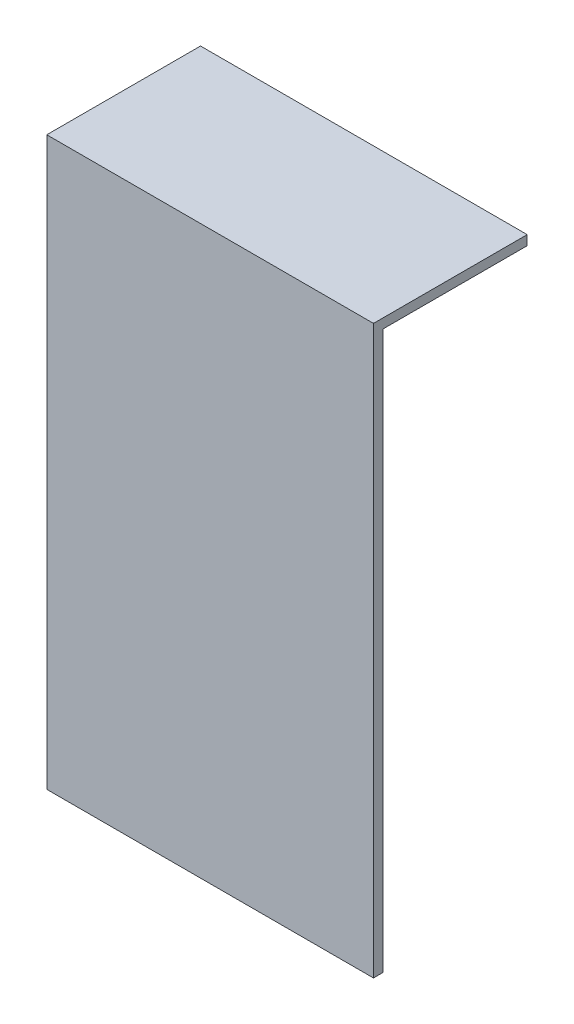
ISO-10303-21;
HEADER;
FILE_DESCRIPTION(('STEP AP214'),'2;1');
FILE_NAME('part.step','',(''),(''),'','','');
FILE_SCHEMA(('AUTOMOTIVE_DESIGN { 1 0 10303 214 1 1 1 1 }'));
ENDSEC;
DATA;
#1=APPLICATION_CONTEXT('core data for automotive mechanical design processes');
#2=APPLICATION_PROTOCOL_DEFINITION('international standard','automotive_design',2000,#1);
#3=PRODUCT_CONTEXT('',#1,'mechanical');
#4=PRODUCT('Part','Part','',(#3));
#5=PRODUCT_RELATED_PRODUCT_CATEGORY('part','',(#4));
#6=PRODUCT_DEFINITION_FORMATION('','',#4);
#7=PRODUCT_DEFINITION_CONTEXT('part definition',#1,'design');
#8=PRODUCT_DEFINITION('design','',#6,#7);
#9=PRODUCT_DEFINITION_SHAPE('','',#8);
#10=(LENGTH_UNIT() NAMED_UNIT(*) SI_UNIT(.MILLI.,.METRE.));
#11=(NAMED_UNIT(*) PLANE_ANGLE_UNIT() SI_UNIT($,.RADIAN.));
#12=(NAMED_UNIT(*) SI_UNIT($,.STERADIAN.) SOLID_ANGLE_UNIT());
#13=UNCERTAINTY_MEASURE_WITH_UNIT(LENGTH_MEASURE(1.E-05),#10,'distance_accuracy_value','');
#14=(GEOMETRIC_REPRESENTATION_CONTEXT(3) GLOBAL_UNCERTAINTY_ASSIGNED_CONTEXT((#13)) GLOBAL_UNIT_ASSIGNED_CONTEXT((#10,
#11,#12)) REPRESENTATION_CONTEXT('',''));
#15=CARTESIAN_POINT('',(0.,0.,0.));
#16=DIRECTION('',(0.,0.,1.));
#17=DIRECTION('',(1.,0.,0.));
#18=AXIS2_PLACEMENT_3D('',#15,#16,#17);
#19=CARTESIAN_POINT('',(-43.18,149.86,-1.27));
#20=DIRECTION('',(0.,0.,1.));
#21=DIRECTION('',(1.,0.,0.));
#22=AXIS2_PLACEMENT_3D('',#19,#20,#21);
#23=PLANE('',#22);
#24=DIRECTION('',(-1.,0.,0.));
#25=VECTOR('',#24,1.);
#26=CARTESIAN_POINT('',(43.18,147.32,-1.27));
#27=LINE('',#26,#25);
#28=CARTESIAN_POINT('',(43.18,147.32,-1.27));
#29=VERTEX_POINT('',#28);
#30=CARTESIAN_POINT('',(-43.18,147.32,-1.27));
#31=VERTEX_POINT('',#30);
#32=EDGE_CURVE('E49',#29,#31,#27,.T.);
#33=ORIENTED_EDGE('',*,*,#32,.F.);
#34=DIRECTION('',(0.,-1.,0.));
#35=VECTOR('',#34,1.);
#36=CARTESIAN_POINT('',(43.18,149.86,-1.27));
#37=LINE('',#36,#35);
#38=CARTESIAN_POINT('',(43.18,0.,-1.27));
#39=VERTEX_POINT('',#38);
#40=EDGE_CURVE('E11',#29,#39,#37,.T.);
#41=ORIENTED_EDGE('',*,*,#40,.T.);
#42=DIRECTION('',(-1.,0.,0.));
#43=VECTOR('',#42,1.);
#44=CARTESIAN_POINT('',(-43.18,0.,-1.27));
#45=LINE('',#44,#43);
#46=CARTESIAN_POINT('',(-43.18,0.,-1.27));
#47=VERTEX_POINT('',#46);
#48=EDGE_CURVE('E97',#39,#47,#45,.T.);
#49=ORIENTED_EDGE('',*,*,#48,.T.);
#50=DIRECTION('',(0.,-1.,0.));
#51=VECTOR('',#50,1.);
#52=CARTESIAN_POINT('',(-43.18,149.86,-1.27));
#53=LINE('',#52,#51);
#54=EDGE_CURVE('E43',#31,#47,#53,.T.);
#55=ORIENTED_EDGE('',*,*,#54,.F.);
#56=EDGE_LOOP('',(#33,#41,#49,#55));
#57=FACE_BOUND('',#56,.T.);
#58=ADVANCED_FACE('F35',(#57),#23,.F.);
#59=CARTESIAN_POINT('',(43.18,149.86,1.27));
#60=DIRECTION('',(-1.,0.,0.));
#61=DIRECTION('',(0.,0.,1.));
#62=AXIS2_PLACEMENT_3D('',#59,#60,#61);
#63=PLANE('',#62);
#64=DIRECTION('',(0.,0.,-1.));
#65=VECTOR('',#64,1.);
#66=CARTESIAN_POINT('',(43.18,0.,1.27));
#67=LINE('',#66,#65);
#68=CARTESIAN_POINT('',(43.18,0.,1.27));
#69=VERTEX_POINT('',#68);
#70=EDGE_CURVE('E91',#69,#39,#67,.T.);
#71=ORIENTED_EDGE('',*,*,#70,.T.);
#72=ORIENTED_EDGE('',*,*,#40,.F.);
#73=DIRECTION('',(0.,0.,1.));
#74=VECTOR('',#73,1.);
#75=CARTESIAN_POINT('',(43.18,147.32,-39.37));
#76=LINE('',#75,#74);
#77=CARTESIAN_POINT('',(43.18,147.32,-39.37));
#78=VERTEX_POINT('',#77);
#79=EDGE_CURVE('E98',#78,#29,#76,.T.);
#80=ORIENTED_EDGE('',*,*,#79,.F.);
#81=DIRECTION('',(0.,-1.,0.));
#82=VECTOR('',#81,1.);
#83=CARTESIAN_POINT('',(43.18,149.86,-39.37));
#84=LINE('',#83,#82);
#85=CARTESIAN_POINT('',(43.18,149.86,-39.37));
#86=VERTEX_POINT('',#85);
#87=EDGE_CURVE('E127',#86,#78,#84,.T.);
#88=ORIENTED_EDGE('',*,*,#87,.F.);
#89=DIRECTION('',(0.,0.,-1.));
#90=VECTOR('',#89,1.);
#91=CARTESIAN_POINT('',(43.18,149.86,1.27));
#92=LINE('',#91,#90);
#93=CARTESIAN_POINT('',(43.18,149.86,1.27));
#94=VERTEX_POINT('',#93);
#95=EDGE_CURVE('E86',#94,#86,#92,.T.);
#96=ORIENTED_EDGE('',*,*,#95,.F.);
#97=DIRECTION('',(0.,-1.,0.));
#98=VECTOR('',#97,1.);
#99=CARTESIAN_POINT('',(43.18,149.86,1.27));
#100=LINE('',#99,#98);
#101=EDGE_CURVE('E79',#94,#69,#100,.T.);
#102=ORIENTED_EDGE('',*,*,#101,.T.);
#103=EDGE_LOOP('',(#71,#72,#80,#88,#96,#102));
#104=FACE_BOUND('',#103,.T.);
#105=ADVANCED_FACE('F37',(#104),#63,.F.);
#106=CARTESIAN_POINT('',(-43.18,149.86,1.27));
#107=DIRECTION('',(1.,0.,0.));
#108=DIRECTION('',(0.,0.,-1.));
#109=AXIS2_PLACEMENT_3D('',#106,#107,#108);
#110=PLANE('',#109);
#111=DIRECTION('',(0.,0.,1.));
#112=VECTOR('',#111,1.);
#113=CARTESIAN_POINT('',(-43.18,0.,1.27));
#114=LINE('',#113,#112);
#115=CARTESIAN_POINT('',(-43.18,0.,1.27));
#116=VERTEX_POINT('',#115);
#117=EDGE_CURVE('E87',#47,#116,#114,.T.);
#118=ORIENTED_EDGE('',*,*,#117,.T.);
#119=DIRECTION('',(0.,-1.,0.));
#120=VECTOR('',#119,1.);
#121=CARTESIAN_POINT('',(-43.18,149.86,1.27));
#122=LINE('',#121,#120);
#123=CARTESIAN_POINT('',(-43.18,149.86,1.27));
#124=VERTEX_POINT('',#123);
#125=EDGE_CURVE('E82',#124,#116,#122,.T.);
#126=ORIENTED_EDGE('',*,*,#125,.F.);
#127=DIRECTION('',(0.,0.,1.));
#128=VECTOR('',#127,1.);
#129=CARTESIAN_POINT('',(-43.18,149.86,1.27));
#130=LINE('',#129,#128);
#131=CARTESIAN_POINT('',(-43.18,149.86,-39.37));
#132=VERTEX_POINT('',#131);
#133=EDGE_CURVE('E139',#132,#124,#130,.T.);
#134=ORIENTED_EDGE('',*,*,#133,.F.);
#135=DIRECTION('',(0.,1.,0.));
#136=VECTOR('',#135,1.);
#137=CARTESIAN_POINT('',(-43.18,149.86,-39.37));
#138=LINE('',#137,#136);
#139=CARTESIAN_POINT('',(-43.18,147.32,-39.37));
#140=VERTEX_POINT('',#139);
#141=EDGE_CURVE('E126',#140,#132,#138,.T.);
#142=ORIENTED_EDGE('',*,*,#141,.F.);
#143=DIRECTION('',(0.,0.,1.));
#144=VECTOR('',#143,1.);
#145=CARTESIAN_POINT('',(-43.18,147.32,-39.37));
#146=LINE('',#145,#144);
#147=EDGE_CURVE('E102',#140,#31,#146,.T.);
#148=ORIENTED_EDGE('',*,*,#147,.T.);
#149=ORIENTED_EDGE('',*,*,#54,.T.);
#150=EDGE_LOOP('',(#118,#126,#134,#142,#148,#149));
#151=FACE_BOUND('',#150,.T.);
#152=ADVANCED_FACE('F110',(#151),#110,.F.);
#153=CARTESIAN_POINT('',(-43.18,149.86,1.27));
#154=DIRECTION('',(0.,0.,-1.));
#155=DIRECTION('',(-1.,0.,0.));
#156=AXIS2_PLACEMENT_3D('',#153,#154,#155);
#157=PLANE('',#156);
#158=DIRECTION('',(1.,0.,0.));
#159=VECTOR('',#158,1.);
#160=CARTESIAN_POINT('',(-43.18,0.,1.27));
#161=LINE('',#160,#159);
#162=EDGE_CURVE('E76',#116,#69,#161,.T.);
#163=ORIENTED_EDGE('',*,*,#162,.T.);
#164=ORIENTED_EDGE('',*,*,#101,.F.);
#165=DIRECTION('',(1.,0.,0.));
#166=VECTOR('',#165,1.);
#167=CARTESIAN_POINT('',(-43.18,149.86,1.27));
#168=LINE('',#167,#166);
#169=EDGE_CURVE('E58',#124,#94,#168,.T.);
#170=ORIENTED_EDGE('',*,*,#169,.F.);
#171=ORIENTED_EDGE('',*,*,#125,.T.);
#172=EDGE_LOOP('',(#163,#164,#170,#171));
#173=FACE_BOUND('',#172,.T.);
#174=ADVANCED_FACE('F78',(#173),#157,.F.);
#175=CARTESIAN_POINT('',(0.,149.86,0.));
#176=DIRECTION('',(0.,-1.,0.));
#177=DIRECTION('',(0.,0.,-1.));
#178=AXIS2_PLACEMENT_3D('',#175,#176,#177);
#179=PLANE('',#178);
#180=ORIENTED_EDGE('',*,*,#95,.T.);
#181=DIRECTION('',(1.,0.,0.));
#182=VECTOR('',#181,1.);
#183=CARTESIAN_POINT('',(43.18,149.86,-39.37));
#184=LINE('',#183,#182);
#185=EDGE_CURVE('E132',#132,#86,#184,.T.);
#186=ORIENTED_EDGE('',*,*,#185,.F.);
#187=ORIENTED_EDGE('',*,*,#133,.T.);
#188=ORIENTED_EDGE('',*,*,#169,.T.);
#189=EDGE_LOOP('',(#180,#186,#187,#188));
#190=FACE_BOUND('',#189,.T.);
#191=ADVANCED_FACE('F141',(#190),#179,.F.);
#192=CARTESIAN_POINT('',(0.,0.,0.));
#193=DIRECTION('',(0.,-1.,0.));
#194=DIRECTION('',(0.,0.,-1.));
#195=AXIS2_PLACEMENT_3D('',#192,#193,#194);
#196=PLANE('',#195);
#197=ORIENTED_EDGE('',*,*,#70,.F.);
#198=ORIENTED_EDGE('',*,*,#162,.F.);
#199=ORIENTED_EDGE('',*,*,#117,.F.);
#200=ORIENTED_EDGE('',*,*,#48,.F.);
#201=EDGE_LOOP('',(#197,#198,#199,#200));
#202=FACE_BOUND('',#201,.T.);
#203=ADVANCED_FACE('F95',(#202),#196,.T.);
#204=CARTESIAN_POINT('',(43.18,147.32,-39.37));
#205=DIRECTION('',(0.,1.,0.));
#206=DIRECTION('',(0.,0.,1.));
#207=AXIS2_PLACEMENT_3D('',#204,#205,#206);
#208=PLANE('',#207);
#209=ORIENTED_EDGE('',*,*,#32,.T.);
#210=ORIENTED_EDGE('',*,*,#147,.F.);
#211=DIRECTION('',(-1.,0.,0.));
#212=VECTOR('',#211,1.);
#213=CARTESIAN_POINT('',(43.18,147.32,-39.37));
#214=LINE('',#213,#212);
#215=EDGE_CURVE('E120',#78,#140,#214,.T.);
#216=ORIENTED_EDGE('',*,*,#215,.F.);
#217=ORIENTED_EDGE('',*,*,#79,.T.);
#218=EDGE_LOOP('',(#209,#210,#216,#217));
#219=FACE_BOUND('',#218,.T.);
#220=ADVANCED_FACE('F118',(#219),#208,.F.);
#221=CARTESIAN_POINT('',(0.,0.,-39.37));
#222=DIRECTION('',(0.,0.,-1.));
#223=DIRECTION('',(-1.,0.,0.));
#224=AXIS2_PLACEMENT_3D('',#221,#222,#223);
#225=PLANE('',#224);
#226=ORIENTED_EDGE('',*,*,#87,.T.);
#227=ORIENTED_EDGE('',*,*,#215,.T.);
#228=ORIENTED_EDGE('',*,*,#141,.T.);
#229=ORIENTED_EDGE('',*,*,#185,.T.);
#230=EDGE_LOOP('',(#226,#227,#228,#229));
#231=FACE_BOUND('',#230,.T.);
#232=ADVANCED_FACE('F130',(#231),#225,.T.);
#233=CLOSED_SHELL('',(#58,#105,#152,#174,#191,#203,#220,#232));
#234=MANIFOLD_SOLID_BREP('B2',#233);
#235=ADVANCED_BREP_SHAPE_REPRESENTATION('',(#18,#234),#14);
#236=SHAPE_DEFINITION_REPRESENTATION(#9,#235);
ENDSEC;
END-ISO-10303-21;
